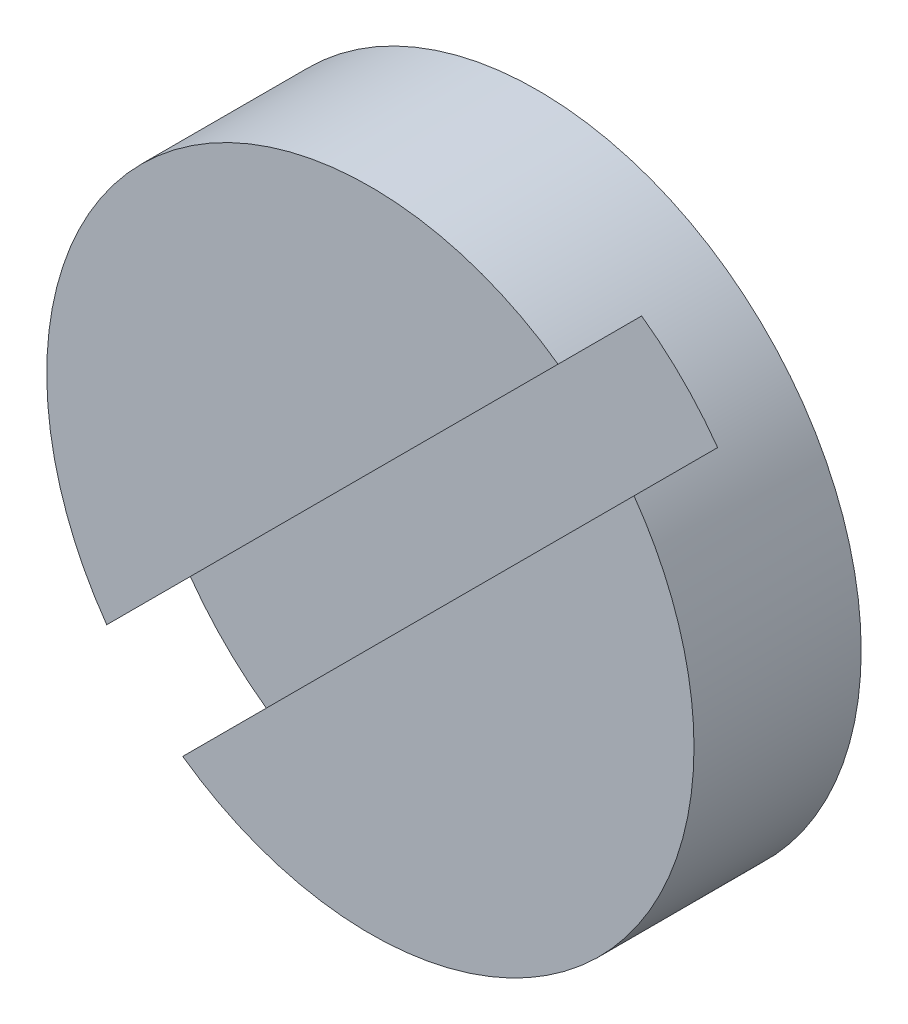
ISO-10303-21;
HEADER;
FILE_DESCRIPTION(('STEP AP214'),'2;1');
FILE_NAME('part.step','',(''),(''),'','','');
FILE_SCHEMA(('AUTOMOTIVE_DESIGN { 1 0 10303 214 1 1 1 1 }'));
ENDSEC;
DATA;
#1=APPLICATION_CONTEXT('core data for automotive mechanical design processes');
#2=APPLICATION_PROTOCOL_DEFINITION('international standard','automotive_design',2000,#1);
#3=PRODUCT_CONTEXT('',#1,'mechanical');
#4=PRODUCT('Part','Part','',(#3));
#5=PRODUCT_RELATED_PRODUCT_CATEGORY('part','',(#4));
#6=PRODUCT_DEFINITION_FORMATION('','',#4);
#7=PRODUCT_DEFINITION_CONTEXT('part definition',#1,'design');
#8=PRODUCT_DEFINITION('design','',#6,#7);
#9=PRODUCT_DEFINITION_SHAPE('','',#8);
#10=(LENGTH_UNIT() NAMED_UNIT(*) SI_UNIT(.MILLI.,.METRE.));
#11=(NAMED_UNIT(*) PLANE_ANGLE_UNIT() SI_UNIT($,.RADIAN.));
#12=(NAMED_UNIT(*) SI_UNIT($,.STERADIAN.) SOLID_ANGLE_UNIT());
#13=UNCERTAINTY_MEASURE_WITH_UNIT(LENGTH_MEASURE(1.E-05),#10,'distance_accuracy_value','');
#14=(GEOMETRIC_REPRESENTATION_CONTEXT(3) GLOBAL_UNCERTAINTY_ASSIGNED_CONTEXT((#13)) GLOBAL_UNIT_ASSIGNED_CONTEXT((#10,
#11,#12)) REPRESENTATION_CONTEXT('',''));
#15=CARTESIAN_POINT('',(0.,0.,0.));
#16=DIRECTION('',(0.,0.,1.));
#17=DIRECTION('',(1.,0.,0.));
#18=AXIS2_PLACEMENT_3D('',#15,#16,#17);
#19=CARTESIAN_POINT('',(54.5331207427251,38.3123307843678,15.6083));
#20=DIRECTION('',(0.707106781186549,-0.707106781186546,0.));
#21=DIRECTION('',(0.,0.,-1.));
#22=AXIS2_PLACEMENT_3D('',#19,#20,#21);
#23=PLANE('',#22);
#24=DIRECTION('',(0.,0.,1.));
#25=VECTOR('',#24,1.);
#26=CARTESIAN_POINT('',(59.8128197558129,43.5920297974556,15.0749));
#27=LINE('',#26,#25);
#28=CARTESIAN_POINT('',(59.8128197558127,43.5920297974555,14.6304));
#29=VERTEX_POINT('',#28);
#30=CARTESIAN_POINT('',(59.8128197558127,43.5920297974555,15.5194));
#31=VERTEX_POINT('',#30);
#32=EDGE_CURVE('E79',#29,#31,#27,.T.);
#33=ORIENTED_EDGE('',*,*,#32,.T.);
#34=DIRECTION('',(0.707106781186548,0.707106781186548,0.));
#35=VECTOR('',#34,1.);
#36=CARTESIAN_POINT('',(57.4129565680457,41.1921666096885,15.5194));
#37=LINE('',#36,#35);
#38=CARTESIAN_POINT('',(55.0130933802785,38.7923034219213,15.5194));
#39=VERTEX_POINT('',#38);
#40=EDGE_CURVE('E81',#39,#31,#37,.T.);
#41=ORIENTED_EDGE('',*,*,#40,.F.);
#42=DIRECTION('',(0.,0.,-1.));
#43=VECTOR('',#42,1.);
#44=CARTESIAN_POINT('',(55.0130933802785,38.7923034219212,15.0749));
#45=LINE('',#44,#43);
#46=CARTESIAN_POINT('',(55.0130933802785,38.7923034219213,14.6304));
#47=VERTEX_POINT('',#46);
#48=EDGE_CURVE('E82',#39,#47,#45,.T.);
#49=ORIENTED_EDGE('',*,*,#48,.T.);
#50=DIRECTION('',(-0.707106781186547,-0.707106781186548,0.));
#51=VECTOR('',#50,1.);
#52=CARTESIAN_POINT('',(57.4129565680455,41.1921666096883,14.6304));
#53=LINE('',#52,#51);
#54=EDGE_CURVE('E66',#29,#47,#53,.T.);
#55=ORIENTED_EDGE('',*,*,#54,.F.);
#56=EDGE_LOOP('',(#33,#41,#49,#55));
#57=FACE_BOUND('',#56,.T.);
#58=ADVANCED_FACE('F17',(#57),#23,.T.);
#59=CARTESIAN_POINT('',(57.0943388372413,48.0351385450642,15.5194));
#60=DIRECTION('',(0.,0.,1.));
#61=DIRECTION('',(-0.707106781186547,-0.707106781186547,0.));
#62=AXIS2_PLACEMENT_3D('',#59,#60,#61);
#63=PLANE('',#62);
#64=ORIENTED_EDGE('',*,*,#40,.T.);
#65=CARTESIAN_POINT('',(57.8170680934936,40.7880550842403,15.5194));
#66=DIRECTION('',(0.,0.,1.));
#67=DIRECTION('',(1.,0.,0.));
#68=AXIS2_PLACEMENT_3D('',#65,#66,#67);
#69=CIRCLE('',#68,3.44169999999972);
#70=EDGE_CURVE('E67',#39,#31,#69,.F.);
#71=ORIENTED_EDGE('',*,*,#70,.F.);
#72=EDGE_LOOP('',(#64,#71));
#73=FACE_BOUND('',#72,.T.);
#74=ADVANCED_FACE('F91',(#73),#63,.T.);
#75=CARTESIAN_POINT('',(57.8170680934936,34.0585157725236,14.6304));
#76=DIRECTION('',(0.,0.,1.));
#77=DIRECTION('',(0.707106781186548,0.707106781186547,0.));
#78=AXIS2_PLACEMENT_3D('',#75,#76,#77);
#79=PLANE('',#78);
#80=ORIENTED_EDGE('',*,*,#54,.T.);
#81=CARTESIAN_POINT('',(57.8170680934936,40.7880550842403,14.6304));
#82=DIRECTION('',(0.,0.,1.));
#83=DIRECTION('',(1.,0.,0.));
#84=AXIS2_PLACEMENT_3D('',#81,#82,#83);
#85=CIRCLE('',#84,3.44169999999972);
#86=CARTESIAN_POINT('',(55.8213164311746,37.9840803710252,14.6304));
#87=VERTEX_POINT('',#86);
#88=EDGE_CURVE('E21',#87,#47,#85,.F.);
#89=ORIENTED_EDGE('',*,*,#88,.F.);
#90=DIRECTION('',(-0.707106781186563,-0.707106781186532,0.));
#91=VECTOR('',#90,1.);
#92=CARTESIAN_POINT('',(58.2211796189418,40.3839435587922,14.6304));
#93=LINE('',#92,#91);
#94=CARTESIAN_POINT('',(60.6210428067089,42.7838067465592,14.6304));
#95=VERTEX_POINT('',#94);
#96=EDGE_CURVE('E63',#95,#87,#93,.T.);
#97=ORIENTED_EDGE('',*,*,#96,.F.);
#98=CARTESIAN_POINT('',(57.8170680934936,40.7880550842403,14.6304));
#99=DIRECTION('',(0.,0.,1.));
#100=DIRECTION('',(1.,0.,0.));
#101=AXIS2_PLACEMENT_3D('',#98,#99,#100);
#102=CIRCLE('',#101,3.44169999999972);
#103=EDGE_CURVE('E56',#29,#95,#102,.F.);
#104=ORIENTED_EDGE('',*,*,#103,.F.);
#105=EDGE_LOOP('',(#80,#89,#97,#104));
#106=FACE_BOUND('',#105,.T.);
#107=ADVANCED_FACE('F62',(#106),#79,.T.);
#108=CARTESIAN_POINT('',(55.3413437936212,37.5041077334717,14.5415));
#109=DIRECTION('',(-0.707106781186533,0.707106781186562,0.));
#110=DIRECTION('',(0.,0.,1.));
#111=AXIS2_PLACEMENT_3D('',#108,#109,#110);
#112=PLANE('',#111);
#113=DIRECTION('',(0.,0.,-1.));
#114=VECTOR('',#113,1.);
#115=CARTESIAN_POINT('',(60.6210428067091,42.7838067465594,15.0749));
#116=LINE('',#115,#114);
#117=CARTESIAN_POINT('',(60.6210428067089,42.7838067465593,15.5194));
#118=VERTEX_POINT('',#117);
#119=EDGE_CURVE('E71',#118,#95,#116,.T.);
#120=ORIENTED_EDGE('',*,*,#119,.T.);
#121=ORIENTED_EDGE('',*,*,#96,.T.);
#122=DIRECTION('',(0.,0.,1.));
#123=VECTOR('',#122,1.);
#124=CARTESIAN_POINT('',(55.8213164311746,37.9840803710251,15.0749));
#125=LINE('',#124,#123);
#126=CARTESIAN_POINT('',(55.8213164311746,37.9840803710252,15.5194));
#127=VERTEX_POINT('',#126);
#128=EDGE_CURVE('E36',#87,#127,#125,.T.);
#129=ORIENTED_EDGE('',*,*,#128,.T.);
#130=DIRECTION('',(-0.707106781186548,-0.707106781186548,0.));
#131=VECTOR('',#130,1.);
#132=CARTESIAN_POINT('',(58.2211796189418,40.3839435587924,15.5194));
#133=LINE('',#132,#131);
#134=EDGE_CURVE('E74',#118,#127,#133,.T.);
#135=ORIENTED_EDGE('',*,*,#134,.F.);
#136=EDGE_LOOP('',(#120,#121,#129,#135));
#137=FACE_BOUND('',#136,.T.);
#138=ADVANCED_FACE('F73',(#137),#112,.T.);
#139=CARTESIAN_POINT('',(49.6089257427987,40.7880550842403,13.7414));
#140=DIRECTION('',(0.,0.,-1.));
#141=DIRECTION('',(0.707106781186535,0.707106781186559,0.));
#142=AXIS2_PLACEMENT_3D('',#139,#140,#141);
#143=PLANE('',#142);
#144=CARTESIAN_POINT('',(57.8170680934936,40.7880550842403,13.7414));
#145=DIRECTION('',(0.,0.,1.));
#146=DIRECTION('',(1.,0.,0.));
#147=AXIS2_PLACEMENT_3D('',#144,#145,#146);
#148=CIRCLE('',#147,3.44169999999972);
#149=CARTESIAN_POINT('',(61.2587680934933,40.7880550842403,13.7414));
#150=VERTEX_POINT('',#149);
#151=EDGE_CURVE('E27',#150,#150,#148,.T.);
#152=ORIENTED_EDGE('',*,*,#151,.F.);
#153=EDGE_LOOP('',(#152));
#154=FACE_BOUND('',#153,.T.);
#155=ADVANCED_FACE('F107',(#154),#143,.T.);
#156=CARTESIAN_POINT('',(58.5397973497462,46.5896800325595,15.5194));
#157=DIRECTION('',(0.,0.,1.));
#158=DIRECTION('',(-0.707106781186547,-0.707106781186547,0.));
#159=AXIS2_PLACEMENT_3D('',#156,#157,#158);
#160=PLANE('',#159);
#161=ORIENTED_EDGE('',*,*,#134,.T.);
#162=CARTESIAN_POINT('',(57.8170680934936,40.7880550842403,15.5194));
#163=DIRECTION('',(0.,0.,1.));
#164=DIRECTION('',(1.,0.,0.));
#165=AXIS2_PLACEMENT_3D('',#162,#163,#164);
#166=CIRCLE('',#165,3.44169999999972);
#167=EDGE_CURVE('E11',#118,#127,#166,.F.);
#168=ORIENTED_EDGE('',*,*,#167,.F.);
#169=EDGE_LOOP('',(#161,#168));
#170=FACE_BOUND('',#169,.T.);
#171=ADVANCED_FACE('F19',(#170),#160,.T.);
#172=CARTESIAN_POINT('',(57.8170680934936,40.7880550842403,15.5194));
#173=DIRECTION('',(0.,0.,1.));
#174=DIRECTION('',(1.,0.,0.));
#175=AXIS2_PLACEMENT_3D('',#172,#173,#174);
#176=CYLINDRICAL_SURFACE('',#175,3.44169999999972);
#177=ORIENTED_EDGE('',*,*,#128,.F.);
#178=ORIENTED_EDGE('',*,*,#88,.T.);
#179=ORIENTED_EDGE('',*,*,#48,.F.);
#180=ORIENTED_EDGE('',*,*,#70,.T.);
#181=ORIENTED_EDGE('',*,*,#32,.F.);
#182=ORIENTED_EDGE('',*,*,#103,.T.);
#183=ORIENTED_EDGE('',*,*,#119,.F.);
#184=ORIENTED_EDGE('',*,*,#167,.T.);
#185=EDGE_LOOP('',(#177,#178,#179,#180,#181,#182,#183,#184));
#186=FACE_BOUND('',#185,.T.);
#187=ORIENTED_EDGE('',*,*,#151,.T.);
#188=EDGE_LOOP('',(#187));
#189=FACE_BOUND('',#188,.T.);
#190=ADVANCED_FACE('F68',(#186,#189),#176,.T.);
#191=CLOSED_SHELL('',(#58,#74,#107,#138,#155,#171,#190));
#192=MANIFOLD_SOLID_BREP('B1',#191);
#193=ADVANCED_BREP_SHAPE_REPRESENTATION('',(#18,#192),#14);
#194=SHAPE_DEFINITION_REPRESENTATION(#9,#193);
ENDSEC;
END-ISO-10303-21;
